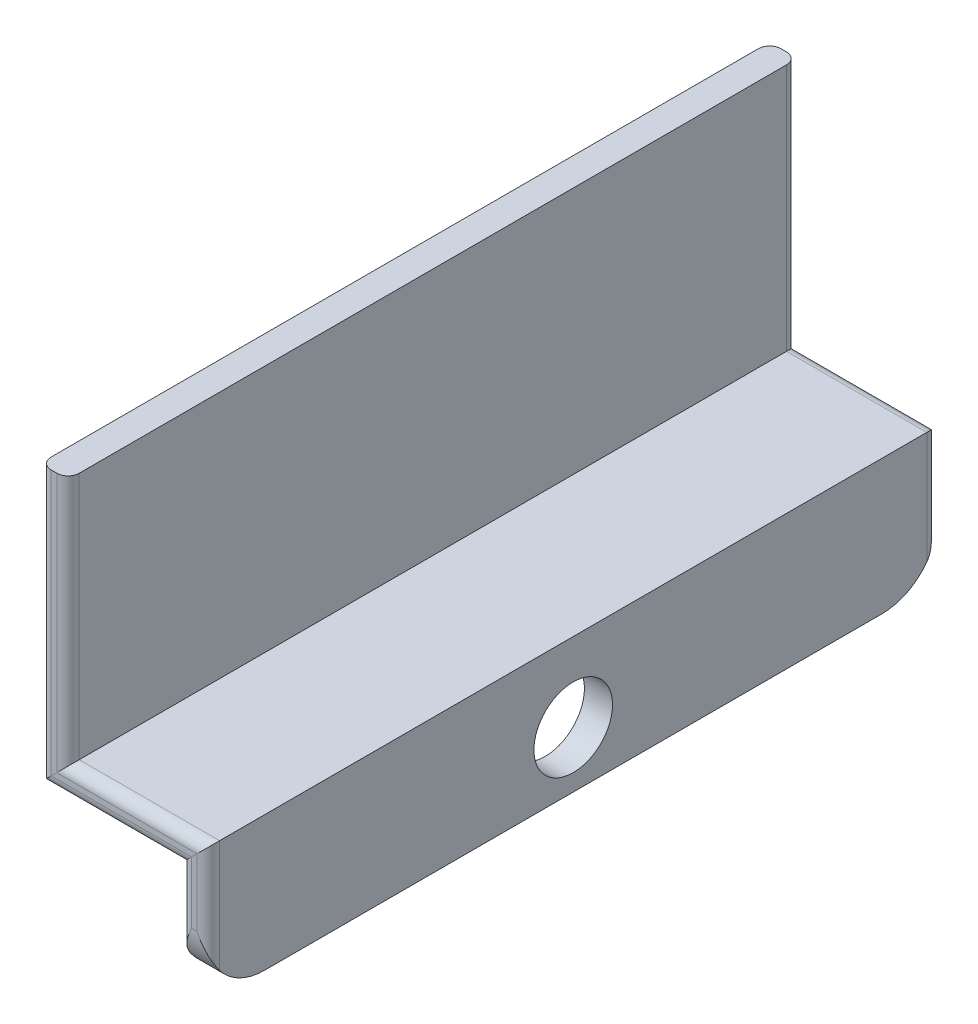
ISO-10303-21;
HEADER;
FILE_DESCRIPTION(('STEP AP214'),'2;1');
FILE_NAME('part.step','',(''),(''),'','','');
FILE_SCHEMA(('AUTOMOTIVE_DESIGN { 1 0 10303 214 1 1 1 1 }'));
ENDSEC;
DATA;
#1=APPLICATION_CONTEXT('core data for automotive mechanical design processes');
#2=APPLICATION_PROTOCOL_DEFINITION('international standard','automotive_design',2000,#1);
#3=PRODUCT_CONTEXT('',#1,'mechanical');
#4=PRODUCT('Part','Part','',(#3));
#5=PRODUCT_RELATED_PRODUCT_CATEGORY('part','',(#4));
#6=PRODUCT_DEFINITION_FORMATION('','',#4);
#7=PRODUCT_DEFINITION_CONTEXT('part definition',#1,'design');
#8=PRODUCT_DEFINITION('design','',#6,#7);
#9=PRODUCT_DEFINITION_SHAPE('','',#8);
#10=(LENGTH_UNIT() NAMED_UNIT(*) SI_UNIT(.MILLI.,.METRE.));
#11=(NAMED_UNIT(*) PLANE_ANGLE_UNIT() SI_UNIT($,.RADIAN.));
#12=(NAMED_UNIT(*) SI_UNIT($,.STERADIAN.) SOLID_ANGLE_UNIT());
#13=UNCERTAINTY_MEASURE_WITH_UNIT(LENGTH_MEASURE(1.E-05),#10,'distance_accuracy_value','');
#14=(GEOMETRIC_REPRESENTATION_CONTEXT(3) GLOBAL_UNCERTAINTY_ASSIGNED_CONTEXT((#13)) GLOBAL_UNIT_ASSIGNED_CONTEXT((#10,
#11,#12)) REPRESENTATION_CONTEXT('',''));
#15=CARTESIAN_POINT('',(0.,0.,0.));
#16=DIRECTION('',(0.,0.,1.));
#17=DIRECTION('',(1.,0.,0.));
#18=AXIS2_PLACEMENT_3D('',#15,#16,#17);
#19=CARTESIAN_POINT('',(-0.499999999999993,10.,55.));
#20=DIRECTION('',(1.,0.,0.));
#21=DIRECTION('',(0.,0.,-1.));
#22=AXIS2_PLACEMENT_3D('',#19,#20,#21);
#23=CYLINDRICAL_SURFACE('',#22,10.);
#24=DIRECTION('',(1.,0.,0.));
#25=VECTOR('',#24,1.);
#26=CARTESIAN_POINT('',(-0.499999999999993,10.,65.));
#27=LINE('',#26,#25);
#28=CARTESIAN_POINT('',(-0.499999999999993,10.,65.));
#29=VERTEX_POINT('',#28);
#30=CARTESIAN_POINT('',(0.500000000000008,10.,65.));
#31=VERTEX_POINT('',#30);
#32=EDGE_CURVE('E347',#29,#31,#27,.T.);
#33=ORIENTED_EDGE('',*,*,#32,.F.);
#34=CARTESIAN_POINT('',(-2.49999999999999,4.00000000000001,63.));
#35=CARTESIAN_POINT('',(-2.49999547043244,4.06304637753697,63.0472862882958));
#36=CARTESIAN_POINT('',(-2.49832361454912,4.12663757747305,63.093813478753));
#37=CARTESIAN_POINT('',(-2.49192859183356,4.25478005250355,63.1852695333377));
#38=CARTESIAN_POINT('',(-2.48720638983413,4.31933101771625,63.2301988981225));
#39=CARTESIAN_POINT('',(-2.46891171954804,4.51402968416605,63.3623378279782));
#40=CARTESIAN_POINT('',(-2.45120888558428,4.64547618874946,63.4470878572115));
#41=CARTESIAN_POINT('',(-2.40682523983019,4.91010869140637,63.6091190391928));
#42=CARTESIAN_POINT('',(-2.38020606759935,5.0432768704808,63.6864469043147));
#43=CARTESIAN_POINT('',(-2.31945242255605,5.31177170751565,63.8342526275325));
#44=CARTESIAN_POINT('',(-2.28531301078787,5.44709972953324,63.904725939813));
#45=CARTESIAN_POINT('',(-2.18706305090996,5.8061393307985,64.0814771097219));
#46=CARTESIAN_POINT('',(-2.11770825700137,6.03127255594251,64.1819879312216));
#47=CARTESIAN_POINT('',(-1.96662002756913,6.48468424964298,64.364955146067));
#48=CARTESIAN_POINT('',(-1.88488135721311,6.71296401101095,64.4474038680966));
#49=CARTESIAN_POINT('',(-1.7119794583594,7.17260428488559,64.5950152471494));
#50=CARTESIAN_POINT('',(-1.6207807482313,7.40397333561157,64.6601092975224));
#51=CARTESIAN_POINT('',(-1.43190515621657,7.86814150222461,64.7730351186085));
#52=CARTESIAN_POINT('',(-1.3342303647904,8.10094013484107,64.8208724279425));
#53=CARTESIAN_POINT('',(-1.11715554079996,8.60820812759128,64.9065704488633));
#54=CARTESIAN_POINT('',(-0.996936925704238,8.88286585590204,64.9412373642432));
#55=CARTESIAN_POINT('',(-0.753857161670149,9.43229712763855,64.9876693958687));
#56=CARTESIAN_POINT('',(-0.631002027540831,9.70706924260041,64.9994819850184));
#57=CARTESIAN_POINT('',(-0.505443288842875,9.98782843433309,64.99999444154));
#58=CARTESIAN_POINT('',(-0.502721632048848,9.99391424381279,64.9999999968566));
#59=CARTESIAN_POINT('',(-0.499999999999993,10.,65.));
#60=B_SPLINE_CURVE_WITH_KNOTS('',3,(#34,#35,#36,#37,#38,#39,#40,#41,#42,#43,#44,#45,#46,#47,#48,
#49,#50,#51,#52,#53,#54,#55,#56,#57,#58,#59),.UNSPECIFIED.,.F.,.F.,(4,2,2,2,2,2,2,2,2,2,2,2,4),
(0.,0.236371159892512,0.472667591527449,0.944315101861264,1.41276713949794,1.88152775757087,
2.64870335126649,3.41620414998905,4.18669550285099,4.95693934291841,5.86148159841717,
6.76414291697835,6.78414292392341),.UNSPECIFIED.);
#61=CARTESIAN_POINT('',(-2.49999999999999,4.00000000000001,63.));
#62=VERTEX_POINT('',#61);
#63=EDGE_CURVE('E11',#62,#29,#60,.T.);
#64=ORIENTED_EDGE('',*,*,#63,.F.);
#65=CARTESIAN_POINT('',(-2.49999999999999,10.,55.));
#66=DIRECTION('',(-1.,0.,0.));
#67=DIRECTION('',(0.,0.,1.));
#68=AXIS2_PLACEMENT_3D('',#65,#66,#67);
#69=CIRCLE('',#68,10.);
#70=CARTESIAN_POINT('',(-2.49999999999999,0.,55.));
#71=VERTEX_POINT('',#70);
#72=EDGE_CURVE('E49',#71,#62,#69,.T.);
#73=ORIENTED_EDGE('',*,*,#72,.F.);
#74=DIRECTION('',(1.,0.,0.));
#75=VECTOR('',#74,1.);
#76=CARTESIAN_POINT('',(0.499999999999992,0.,55.));
#77=LINE('',#76,#75);
#78=CARTESIAN_POINT('',(2.50000000000001,0.,55.));
#79=VERTEX_POINT('',#78);
#80=EDGE_CURVE('E474',#79,#71,#77,.F.);
#81=ORIENTED_EDGE('',*,*,#80,.F.);
#82=CARTESIAN_POINT('',(2.50000000000001,10.,55.));
#83=DIRECTION('',(1.,0.,0.));
#84=DIRECTION('',(0.,0.,-1.));
#85=AXIS2_PLACEMENT_3D('',#82,#83,#84);
#86=CIRCLE('',#85,10.);
#87=CARTESIAN_POINT('',(2.50000000000001,4.00000000000001,63.));
#88=VERTEX_POINT('',#87);
#89=EDGE_CURVE('E475',#88,#79,#86,.T.);
#90=ORIENTED_EDGE('',*,*,#89,.F.);
#91=CARTESIAN_POINT('',(0.500000000000008,10.,65.));
#92=CARTESIAN_POINT('',(0.502721628399615,9.99391425084165,64.9999999965994));
#93=CARTESIAN_POINT('',(0.505443285212219,9.98782844131885,64.9999944412989));
#94=CARTESIAN_POINT('',(0.642839640476698,9.68059946278816,64.999433683535));
#95=CARTESIAN_POINT('',(0.777544798684673,9.37932057803113,64.9852882408832));
#96=CARTESIAN_POINT('',(1.04327113471868,8.77740035527913,64.9295886716854));
#97=CARTESIAN_POINT('',(1.17428874575255,8.47675987815172,64.8880088990259));
#98=CARTESIAN_POINT('',(1.42867458267128,7.87673702040747,64.7767569341569));
#99=CARTESIAN_POINT('',(1.55202957555319,7.57735760535633,64.7070376217039));
#100=CARTESIAN_POINT('',(1.78572898308166,6.98194801878022,64.5387111228695));
#101=CARTESIAN_POINT('',(1.89608655158132,6.68591474005417,64.4401335005981));
#102=CARTESIAN_POINT('',(2.09232369803455,6.11354886559747,64.2187128467075));
#103=CARTESIAN_POINT('',(2.17916593611921,5.83698257130332,64.0973671885433));
#104=CARTESIAN_POINT('',(2.29024836784087,5.42797135928678,63.8949186385683));
#105=CARTESIAN_POINT('',(2.32402390435839,5.29290748653502,63.8242143371832));
#106=CARTESIAN_POINT('',(2.38402833961434,5.02484413603067,63.6759018440058));
#107=CARTESIAN_POINT('',(2.41025661874056,4.89184482862158,63.5982930860581));
#108=CARTESIAN_POINT('',(2.45026840218955,4.64893178433829,63.4488538806291));
#109=CARTESIAN_POINT('',(2.46535101868504,4.5386363826575,63.3779936451009));
#110=CARTESIAN_POINT('',(2.48791968612418,4.32044190393643,63.2316379999814));
#111=CARTESIAN_POINT('',(2.49541038857459,4.21254139925162,63.1561454586777));
#112=CARTESIAN_POINT('',(2.50153963009505,3.99856716219276,63.000031068604));
#113=CARTESIAN_POINT('',(2.50009094149456,3.89252158861953,62.9193663015082));
#114=CARTESIAN_POINT('',(2.48994271305687,3.73615542879902,62.7954277633358));
#115=CARTESIAN_POINT('',(2.48522141633947,3.68442974533144,62.75357823854));
#116=CARTESIAN_POINT('',(2.47288472291966,3.58201051799564,62.6690174067095));
#117=CARTESIAN_POINT('',(2.46526832160248,3.53131733885191,62.6263058054075));
#118=CARTESIAN_POINT('',(2.4560925472339,3.48120344431526,62.5832243449335));
#119=B_SPLINE_CURVE_WITH_KNOTS('',3,(#91,#92,#93,#94,#95,#96,#97,#98,#99,#100,#101,#102,#103,
#104,#105,#106,#107,#108,#109,#110,#111,#112,#113,#114,#115,#116,#117,#118),.UNSPECIFIED.,.F.,
.F.,(4,2,2,2,2,2,2,2,2,2,2,2,2,4),(0.,0.0200000069444667,1.00964805019351,2.00022254779432,
2.99246271075223,3.98368990203602,4.9242652636444,5.3924313134945,5.86063578772613,
6.2562352909762,6.65159226669092,7.05081306741995,7.25085282834555,7.45096206746141),.UNSPECIFIED.);
#120=EDGE_CURVE('E432',#31,#88,#119,.T.);
#121=ORIENTED_EDGE('',*,*,#120,.F.);
#122=EDGE_LOOP('',(#33,#64,#73,#81,#90,#121));
#123=FACE_BOUND('',#122,.T.);
#124=ADVANCED_FACE('F36',(#123),#23,.T.);
#125=CARTESIAN_POINT('',(-0.500000000000008,10.,-55.));
#126=DIRECTION('',(-1.,0.,0.));
#127=DIRECTION('',(0.,0.,1.));
#128=AXIS2_PLACEMENT_3D('',#125,#126,#127);
#129=CYLINDRICAL_SURFACE('',#128,10.);
#130=DIRECTION('',(-1.,0.,0.));
#131=VECTOR('',#130,1.);
#132=CARTESIAN_POINT('',(-0.500000000000008,10.,-65.));
#133=LINE('',#132,#131);
#134=CARTESIAN_POINT('',(0.499999999999992,10.,-65.));
#135=VERTEX_POINT('',#134);
#136=CARTESIAN_POINT('',(-0.500000000000008,10.,-65.));
#137=VERTEX_POINT('',#136);
#138=EDGE_CURVE('E168',#135,#137,#133,.T.);
#139=ORIENTED_EDGE('',*,*,#138,.F.);
#140=CARTESIAN_POINT('',(2.49999999999999,3.99999999999999,-63.));
#141=CARTESIAN_POINT('',(2.49999547043244,4.06304637753687,-63.0472862882957));
#142=CARTESIAN_POINT('',(2.49832361454912,4.12663757747287,-63.0938134787529));
#143=CARTESIAN_POINT('',(2.49192859183358,4.2547800525032,-63.1852695333375));
#144=CARTESIAN_POINT('',(2.48720638983416,4.31933101771581,-63.2301988981222));
#145=CARTESIAN_POINT('',(2.46891171954812,4.51402968416534,-63.3623378279777));
#146=CARTESIAN_POINT('',(2.4512088855844,4.64547618874857,-63.447087857211));
#147=CARTESIAN_POINT('',(2.40682523983037,4.91010869140545,-63.6091190391923));
#148=CARTESIAN_POINT('',(2.3802060675995,5.04327687048006,-63.6864469043143));
#149=CARTESIAN_POINT('',(2.31945242255614,5.31177170751526,-63.8342526275324));
#150=CARTESIAN_POINT('',(2.28531301078792,5.44709972953303,-63.904725939813));
#151=CARTESIAN_POINT('',(2.18706305090993,5.8061393307986,-64.0814771097219));
#152=CARTESIAN_POINT('',(2.11770825700131,6.03127255594274,-64.1819879312217));
#153=CARTESIAN_POINT('',(1.96662002756895,6.48468424964342,-64.3649551460672));
#154=CARTESIAN_POINT('',(1.88488135721282,6.71296401101147,-64.4474038680968));
#155=CARTESIAN_POINT('',(1.71197945835927,7.17260428488616,-64.5950152471496));
#156=CARTESIAN_POINT('',(1.62078074823145,7.4039733356121,-64.6601092975225));
#157=CARTESIAN_POINT('',(1.43190515621617,7.86814150222462,-64.7730351186086));
#158=CARTESIAN_POINT('',(1.33423036478917,8.10094013484059,-64.8208724279425));
#159=CARTESIAN_POINT('',(1.11715554080136,8.60820812759183,-64.9065704488633));
#160=CARTESIAN_POINT('',(0.996936925709866,8.88286585590448,-64.9412373642432));
#161=CARTESIAN_POINT('',(0.753857161664523,9.43229712763598,-64.9876693958688));
#162=CARTESIAN_POINT('',(0.631002027519763,9.70706924259096,-64.9994819850186));
#163=CARTESIAN_POINT('',(0.505443288841949,9.98782843433267,-64.99999444154));
#164=CARTESIAN_POINT('',(0.502721632048376,9.99391424381258,-64.9999999968566));
#165=CARTESIAN_POINT('',(0.499999999999992,10.,-65.));
#166=B_SPLINE_CURVE_WITH_KNOTS('',3,(#140,#141,#142,#143,#144,#145,#146,#147,#148,#149,#150,
#151,#152,#153,#154,#155,#156,#157,#158,#159,#160,#161,#162,#163,#164,#165),.UNSPECIFIED.,.F.,
.F.,(4,2,2,2,2,2,2,2,2,2,2,2,4),(0.,0.236371159892205,0.47266759152683,0.944315101860007,
1.4127671394973,1.88152775757086,2.6487033512669,3.4162041499898,4.1866955028513,
4.95693934291837,5.8614815984171,6.76414291697836,6.78414292392343),.UNSPECIFIED.);
#167=CARTESIAN_POINT('',(2.49999999999999,3.99999999999999,-63.));
#168=VERTEX_POINT('',#167);
#169=EDGE_CURVE('E339',#168,#135,#166,.T.);
#170=ORIENTED_EDGE('',*,*,#169,.F.);
#171=CARTESIAN_POINT('',(2.49999999999999,10.,-55.));
#172=DIRECTION('',(1.,0.,0.));
#173=DIRECTION('',(0.,0.,-1.));
#174=AXIS2_PLACEMENT_3D('',#171,#172,#173);
#175=CIRCLE('',#174,10.);
#176=CARTESIAN_POINT('',(2.49999999999999,0.,-55.));
#177=VERTEX_POINT('',#176);
#178=EDGE_CURVE('E348',#177,#168,#175,.T.);
#179=ORIENTED_EDGE('',*,*,#178,.F.);
#180=DIRECTION('',(-1.,0.,0.));
#181=VECTOR('',#180,1.);
#182=CARTESIAN_POINT('',(0.499999999999992,0.,-55.));
#183=LINE('',#182,#181);
#184=CARTESIAN_POINT('',(-2.50000000000001,0.,-55.));
#185=VERTEX_POINT('',#184);
#186=EDGE_CURVE('E674',#185,#177,#183,.F.);
#187=ORIENTED_EDGE('',*,*,#186,.F.);
#188=CARTESIAN_POINT('',(-2.50000000000001,10.,-55.));
#189=DIRECTION('',(-1.,0.,0.));
#190=DIRECTION('',(0.,0.,1.));
#191=AXIS2_PLACEMENT_3D('',#188,#189,#190);
#192=CIRCLE('',#191,10.);
#193=CARTESIAN_POINT('',(-2.50000000000001,3.99999999999999,-63.));
#194=VERTEX_POINT('',#193);
#195=EDGE_CURVE('E325',#194,#185,#192,.T.);
#196=ORIENTED_EDGE('',*,*,#195,.F.);
#197=CARTESIAN_POINT('',(-0.500000000000008,10.,-65.));
#198=CARTESIAN_POINT('',(-0.502721628399066,9.99391425084141,-64.9999999965994));
#199=CARTESIAN_POINT('',(-0.505443285211139,9.98782844131837,-64.9999944412989));
#200=CARTESIAN_POINT('',(-0.642839640444456,9.68059946278795,-64.9994336835353));
#201=CARTESIAN_POINT('',(-0.777544798666836,9.37932057805158,-64.9852882408844));
#202=CARTESIAN_POINT('',(-1.04327113470509,8.77740035532974,-64.9295886716909));
#203=CARTESIAN_POINT('',(-1.17428874572878,8.47675987821183,-64.8880088990346));
#204=CARTESIAN_POINT('',(-1.42867458263471,7.87673702048958,-64.7767569341746));
#205=CARTESIAN_POINT('',(-1.55202957551402,7.57735760545096,-64.7070376217272));
#206=CARTESIAN_POINT('',(-1.78572898303726,6.98194801889843,-64.5387111229064));
#207=CARTESIAN_POINT('',(-1.89608655153428,6.68591474018346,-64.440133500643));
#208=CARTESIAN_POINT('',(-2.09232369799681,6.11354886571502,-64.2187128467578));
#209=CARTESIAN_POINT('',(-2.1791659360912,5.83698257139857,-64.0973671885877));
#210=CARTESIAN_POINT('',(-2.29024836782501,5.42797135934904,-63.8949186386005));
#211=CARTESIAN_POINT('',(-2.3240239043462,5.2929074865863,-63.8242143372107));
#212=CARTESIAN_POINT('',(-2.38402833960843,5.02484413606024,-63.675901844023));
#213=CARTESIAN_POINT('',(-2.41025661873727,4.89184482864045,-63.5982930860695));
#214=CARTESIAN_POINT('',(-2.45026840218792,4.64893178434909,-63.448853880636));
#215=CARTESIAN_POINT('',(-2.46535101868332,4.53863638267071,-63.3779936451095));
#216=CARTESIAN_POINT('',(-2.48791968612268,4.32044190395432,-63.2316379999937));
#217=CARTESIAN_POINT('',(-2.49541038857339,4.21254139927179,-63.156145458692));
#218=CARTESIAN_POINT('',(-2.50153963009495,3.99856716221775,-63.0000310686227));
#219=CARTESIAN_POINT('',(-2.5000909414953,3.89252158864704,-62.9193663015294));
#220=CARTESIAN_POINT('',(-2.48994271305941,3.73615542883011,-62.7954277633608));
#221=CARTESIAN_POINT('',(-2.4852214163427,3.68442974536369,-62.7535782385662));
#222=CARTESIAN_POINT('',(-2.47288472292447,3.58201051803014,-62.6690174067384));
#223=CARTESIAN_POINT('',(-2.46526832160818,3.53131733888749,-62.6263058054377));
#224=CARTESIAN_POINT('',(-2.45609254724062,3.48120344435189,-62.583224344965));
#225=B_SPLINE_CURVE_WITH_KNOTS('',3,(#197,#198,#199,#200,#201,#202,#203,#204,#205,#206,#207,
#208,#209,#210,#211,#212,#213,#214,#215,#216,#217,#218,#219,#220,#221,#222,#223,#224),
.UNSPECIFIED.,.F.,.F.,(4,2,2,2,2,2,2,2,2,2,2,2,2,4),(0.,0.0200000069444654,1.00964805015461,
2.00022254771616,2.99246271063398,3.98368990187851,4.92426526356025,5.39243131344749,
5.86063578771627,6.25623529095746,6.65159226666328,7.05081306738183,7.25085282830217,
7.45096206741274),.UNSPECIFIED.);
#226=EDGE_CURVE('E201',#137,#194,#225,.T.);
#227=ORIENTED_EDGE('',*,*,#226,.F.);
#228=EDGE_LOOP('',(#139,#170,#179,#187,#196,#227));
#229=FACE_BOUND('',#228,.T.);
#230=ADVANCED_FACE('F330',(#229),#129,.T.);
#231=CARTESIAN_POINT('',(-24.5,68.2,-63.0000000000001));
#232=DIRECTION('',(0.,-1.,0.));
#233=DIRECTION('',(0.,0.,-1.));
#234=AXIS2_PLACEMENT_3D('',#231,#232,#233);
#235=PLANE('',#234);
#236=CARTESIAN_POINT('',(-24.5,68.2,-63.0000000000001));
#237=DIRECTION('',(0.,1.,0.));
#238=DIRECTION('',(0.,0.,-1.));
#239=AXIS2_PLACEMENT_3D('',#236,#237,#238);
#240=CIRCLE('',#239,2.);
#241=CARTESIAN_POINT('',(-22.5,68.2,-63.0000000000001));
#242=VERTEX_POINT('',#241);
#243=CARTESIAN_POINT('',(-24.5,68.2,-65.0000000000001));
#244=VERTEX_POINT('',#243);
#245=EDGE_CURVE('E277',#242,#244,#240,.T.);
#246=ORIENTED_EDGE('',*,*,#245,.T.);
#247=DIRECTION('',(-1.,0.,0.));
#248=VECTOR('',#247,1.);
#249=CARTESIAN_POINT('',(-25.5,68.2,-65.0000000000001));
#250=LINE('',#249,#248);
#251=CARTESIAN_POINT('',(-25.5,68.2,-65.0000000000001));
#252=VERTEX_POINT('',#251);
#253=EDGE_CURVE('E292',#244,#252,#250,.T.);
#254=ORIENTED_EDGE('',*,*,#253,.T.);
#255=CARTESIAN_POINT('',(-25.5,68.2,-63.0000000000001));
#256=DIRECTION('',(0.,1.,0.));
#257=DIRECTION('',(0.,0.,-1.));
#258=AXIS2_PLACEMENT_3D('',#255,#256,#257);
#259=CIRCLE('',#258,2.);
#260=CARTESIAN_POINT('',(-27.5,68.2,-63.0000000000001));
#261=VERTEX_POINT('',#260);
#262=EDGE_CURVE('E290',#252,#261,#259,.T.);
#263=ORIENTED_EDGE('',*,*,#262,.T.);
#264=DIRECTION('',(0.,0.,1.));
#265=VECTOR('',#264,1.);
#266=CARTESIAN_POINT('',(-27.5,68.2,-63.0000000000001));
#267=LINE('',#266,#265);
#268=CARTESIAN_POINT('',(-27.5,68.2,62.9999999999999));
#269=VERTEX_POINT('',#268);
#270=EDGE_CURVE('E288',#261,#269,#267,.T.);
#271=ORIENTED_EDGE('',*,*,#270,.T.);
#272=CARTESIAN_POINT('',(-25.5,68.2,62.9999999999999));
#273=DIRECTION('',(0.,1.,0.));
#274=DIRECTION('',(0.,0.,-1.));
#275=AXIS2_PLACEMENT_3D('',#272,#273,#274);
#276=CIRCLE('',#275,2.);
#277=CARTESIAN_POINT('',(-25.5,68.2,64.9999999999999));
#278=VERTEX_POINT('',#277);
#279=EDGE_CURVE('E286',#269,#278,#276,.T.);
#280=ORIENTED_EDGE('',*,*,#279,.T.);
#281=DIRECTION('',(1.,0.,0.));
#282=VECTOR('',#281,1.);
#283=CARTESIAN_POINT('',(-25.5,68.2,64.9999999999999));
#284=LINE('',#283,#282);
#285=CARTESIAN_POINT('',(-24.5,68.2,64.9999999999999));
#286=VERTEX_POINT('',#285);
#287=EDGE_CURVE('E284',#278,#286,#284,.T.);
#288=ORIENTED_EDGE('',*,*,#287,.T.);
#289=CARTESIAN_POINT('',(-24.5,68.2,62.9999999999999));
#290=DIRECTION('',(0.,1.,0.));
#291=DIRECTION('',(0.,0.,-1.));
#292=AXIS2_PLACEMENT_3D('',#289,#290,#291);
#293=CIRCLE('',#292,2.);
#294=CARTESIAN_POINT('',(-22.5,68.2,62.9999999999999));
#295=VERTEX_POINT('',#294);
#296=EDGE_CURVE('E282',#286,#295,#293,.T.);
#297=ORIENTED_EDGE('',*,*,#296,.T.);
#298=DIRECTION('',(0.,0.,-1.));
#299=VECTOR('',#298,1.);
#300=CARTESIAN_POINT('',(-22.5,68.2,-63.0000000000001));
#301=LINE('',#300,#299);
#302=EDGE_CURVE('E279',#295,#242,#301,.T.);
#303=ORIENTED_EDGE('',*,*,#302,.T.);
#304=EDGE_LOOP('',(#246,#254,#263,#271,#280,#288,#297,#303));
#305=FACE_BOUND('',#304,.T.);
#306=ADVANCED_FACE('F334',(#305),#235,.F.);
#307=CARTESIAN_POINT('',(0.499999999999992,0.,-63.));
#308=DIRECTION('',(0.,-1.,0.));
#309=DIRECTION('',(0.,0.,-1.));
#310=AXIS2_PLACEMENT_3D('',#307,#308,#309);
#311=PLANE('',#310);
#312=DIRECTION('',(0.,0.,-1.));
#313=VECTOR('',#312,1.);
#314=CARTESIAN_POINT('',(2.49999999999999,0.,-63.));
#315=LINE('',#314,#313);
#316=EDGE_CURVE('E223',#79,#177,#315,.T.);
#317=ORIENTED_EDGE('',*,*,#316,.F.);
#318=ORIENTED_EDGE('',*,*,#80,.T.);
#319=DIRECTION('',(0.,0.,1.));
#320=VECTOR('',#319,1.);
#321=CARTESIAN_POINT('',(-2.50000000000001,0.,-63.));
#322=LINE('',#321,#320);
#323=EDGE_CURVE('E226',#185,#71,#322,.T.);
#324=ORIENTED_EDGE('',*,*,#323,.F.);
#325=ORIENTED_EDGE('',*,*,#186,.T.);
#326=EDGE_LOOP('',(#317,#318,#324,#325));
#327=FACE_BOUND('',#326,.T.);
#328=ADVANCED_FACE('F391',(#327),#311,.T.);
#329=CARTESIAN_POINT('',(-25.5,18.6499999999999,-65.0000000000001));
#330=DIRECTION('',(0.,0.,-1.));
#331=DIRECTION('',(0.,1.,0.));
#332=AXIS2_PLACEMENT_3D('',#329,#330,#331);
#333=PLANE('',#332);
#334=DIRECTION('',(0.707106781186548,0.707106781186548,0.));
#335=VECTOR('',#334,1.);
#336=CARTESIAN_POINT('',(-11.3249999999999,35.175,-65.0000000000001));
#337=LINE('',#336,#335);
#338=CARTESIAN_POINT('',(-25.5,20.9999999999999,-65.0000000000001));
#339=VERTEX_POINT('',#338);
#340=CARTESIAN_POINT('',(-24.5,21.9999999999999,-65.0000000000001));
#341=VERTEX_POINT('',#340);
#342=EDGE_CURVE('E257',#339,#341,#337,.T.);
#343=ORIENTED_EDGE('',*,*,#342,.F.);
#344=DIRECTION('',(0.,1.,0.));
#345=VECTOR('',#344,1.);
#346=CARTESIAN_POINT('',(-25.5,18.6499999999999,-65.0000000000001));
#347=LINE('',#346,#345);
#348=EDGE_CURVE('E312',#339,#252,#347,.T.);
#349=ORIENTED_EDGE('',*,*,#348,.T.);
#350=ORIENTED_EDGE('',*,*,#253,.F.);
#351=DIRECTION('',(0.,1.,0.));
#352=VECTOR('',#351,1.);
#353=CARTESIAN_POINT('',(-24.5,18.6499999999999,-65.0000000000001));
#354=LINE('',#353,#352);
#355=EDGE_CURVE('E262',#341,#244,#354,.T.);
#356=ORIENTED_EDGE('',*,*,#355,.F.);
#357=EDGE_LOOP('',(#343,#349,#350,#356));
#358=FACE_BOUND('',#357,.T.);
#359=ADVANCED_FACE('F387',(#358),#333,.T.);
#360=CARTESIAN_POINT('',(-25.5,18.6499999999999,-63.0000000000001));
#361=DIRECTION('',(0.,1.,0.));
#362=DIRECTION('',(0.,0.,1.));
#363=AXIS2_PLACEMENT_3D('',#360,#361,#362);
#364=CYLINDRICAL_SURFACE('',#363,2.);
#365=CARTESIAN_POINT('',(-25.5,20.9999999999998,-63.0000000000001));
#366=DIRECTION('',(-0.707106781186547,0.707106781186547,0.));
#367=DIRECTION('',(-0.707106781186548,-0.707106781186548,0.));
#368=AXIS2_PLACEMENT_3D('',#365,#366,#367);
#369=ELLIPSE('',#368,2.82842712474619,2.);
#370=CARTESIAN_POINT('',(-27.5,18.9999999999999,-63.0000000000001));
#371=VERTEX_POINT('',#370);
#372=EDGE_CURVE('E194',#371,#339,#369,.F.);
#373=ORIENTED_EDGE('',*,*,#372,.F.);
#374=DIRECTION('',(0.,1.,0.));
#375=VECTOR('',#374,1.);
#376=CARTESIAN_POINT('',(-27.5,18.6499999999999,-63.0000000000001));
#377=LINE('',#376,#375);
#378=EDGE_CURVE('E309',#371,#261,#377,.T.);
#379=ORIENTED_EDGE('',*,*,#378,.T.);
#380=ORIENTED_EDGE('',*,*,#262,.F.);
#381=ORIENTED_EDGE('',*,*,#348,.F.);
#382=EDGE_LOOP('',(#373,#379,#380,#381));
#383=FACE_BOUND('',#382,.T.);
#384=ADVANCED_FACE('F390',(#383),#364,.T.);
#385=CARTESIAN_POINT('',(-27.5,18.6499999999999,-63.0000000000001));
#386=DIRECTION('',(-1.,0.,0.));
#387=DIRECTION('',(0.,0.,1.));
#388=AXIS2_PLACEMENT_3D('',#385,#386,#387);
#389=PLANE('',#388);
#390=DIRECTION('',(0.,0.,-1.));
#391=VECTOR('',#390,1.);
#392=CARTESIAN_POINT('',(-27.5,18.9999999999998,-63.));
#393=LINE('',#392,#391);
#394=CARTESIAN_POINT('',(-27.5,19.0000000000001,62.9999999999999));
#395=VERTEX_POINT('',#394);
#396=EDGE_CURVE('E239',#395,#371,#393,.T.);
#397=ORIENTED_EDGE('',*,*,#396,.F.);
#398=DIRECTION('',(0.,1.,0.));
#399=VECTOR('',#398,1.);
#400=CARTESIAN_POINT('',(-27.5,18.6499999999999,62.9999999999999));
#401=LINE('',#400,#399);
#402=EDGE_CURVE('E306',#395,#269,#401,.T.);
#403=ORIENTED_EDGE('',*,*,#402,.T.);
#404=ORIENTED_EDGE('',*,*,#270,.F.);
#405=ORIENTED_EDGE('',*,*,#378,.F.);
#406=EDGE_LOOP('',(#397,#403,#404,#405));
#407=FACE_BOUND('',#406,.T.);
#408=ADVANCED_FACE('F395',(#407),#389,.T.);
#409=CARTESIAN_POINT('',(-25.5,18.6499999999999,62.9999999999999));
#410=DIRECTION('',(0.,1.,0.));
#411=DIRECTION('',(0.,0.,1.));
#412=AXIS2_PLACEMENT_3D('',#409,#410,#411);
#413=CYLINDRICAL_SURFACE('',#412,2.);
#414=CARTESIAN_POINT('',(-25.5,21.0000000000001,62.9999999999999));
#415=DIRECTION('',(-0.707106781186547,0.707106781186547,0.));
#416=DIRECTION('',(-0.707106781186548,-0.707106781186548,0.));
#417=AXIS2_PLACEMENT_3D('',#414,#415,#416);
#418=ELLIPSE('',#417,2.82842712474619,2.);
#419=CARTESIAN_POINT('',(-25.5,21.0000000000001,64.9999999999999));
#420=VERTEX_POINT('',#419);
#421=EDGE_CURVE('E242',#420,#395,#418,.F.);
#422=ORIENTED_EDGE('',*,*,#421,.F.);
#423=DIRECTION('',(0.,1.,0.));
#424=VECTOR('',#423,1.);
#425=CARTESIAN_POINT('',(-25.5,18.6499999999999,64.9999999999999));
#426=LINE('',#425,#424);
#427=EDGE_CURVE('E303',#420,#278,#426,.T.);
#428=ORIENTED_EDGE('',*,*,#427,.T.);
#429=ORIENTED_EDGE('',*,*,#279,.F.);
#430=ORIENTED_EDGE('',*,*,#402,.F.);
#431=EDGE_LOOP('',(#422,#428,#429,#430));
#432=FACE_BOUND('',#431,.T.);
#433=ADVANCED_FACE('F399',(#432),#413,.T.);
#434=CARTESIAN_POINT('',(-25.5,18.6499999999999,64.9999999999999));
#435=DIRECTION('',(0.,0.,1.));
#436=DIRECTION('',(0.,-1.,0.));
#437=AXIS2_PLACEMENT_3D('',#434,#435,#436);
#438=PLANE('',#437);
#439=DIRECTION('',(-0.707106781186548,-0.707106781186548,0.));
#440=VECTOR('',#439,1.);
#441=CARTESIAN_POINT('',(-11.325,35.1750000000001,64.9999999999999));
#442=LINE('',#441,#440);
#443=CARTESIAN_POINT('',(-24.5,22.0000000000001,64.9999999999999));
#444=VERTEX_POINT('',#443);
#445=EDGE_CURVE('E245',#444,#420,#442,.T.);
#446=ORIENTED_EDGE('',*,*,#445,.F.);
#447=DIRECTION('',(0.,1.,0.));
#448=VECTOR('',#447,1.);
#449=CARTESIAN_POINT('',(-24.5,18.6499999999999,64.9999999999999));
#450=LINE('',#449,#448);
#451=EDGE_CURVE('E300',#444,#286,#450,.T.);
#452=ORIENTED_EDGE('',*,*,#451,.T.);
#453=ORIENTED_EDGE('',*,*,#287,.F.);
#454=ORIENTED_EDGE('',*,*,#427,.F.);
#455=EDGE_LOOP('',(#446,#452,#453,#454));
#456=FACE_BOUND('',#455,.T.);
#457=ADVANCED_FACE('F403',(#456),#438,.T.);
#458=CARTESIAN_POINT('',(-24.5,18.6499999999999,62.9999999999999));
#459=DIRECTION('',(0.,1.,0.));
#460=DIRECTION('',(0.,0.,1.));
#461=AXIS2_PLACEMENT_3D('',#458,#459,#460);
#462=CYLINDRICAL_SURFACE('',#461,2.);
#463=CARTESIAN_POINT('',(-24.5,22.0000000000001,62.9999999999999));
#464=DIRECTION('',(-0.707106781186547,0.707106781186547,0.));
#465=DIRECTION('',(-0.707106781186548,-0.707106781186548,0.));
#466=AXIS2_PLACEMENT_3D('',#463,#464,#465);
#467=ELLIPSE('',#466,2.82842712474619,2.);
#468=CARTESIAN_POINT('',(-22.5,24.0000000000001,62.9999999999999));
#469=VERTEX_POINT('',#468);
#470=EDGE_CURVE('E248',#469,#444,#467,.F.);
#471=ORIENTED_EDGE('',*,*,#470,.F.);
#472=DIRECTION('',(0.,1.,0.));
#473=VECTOR('',#472,1.);
#474=CARTESIAN_POINT('',(-22.5,18.6499999999999,62.9999999999999));
#475=LINE('',#474,#473);
#476=EDGE_CURVE('E297',#469,#295,#475,.T.);
#477=ORIENTED_EDGE('',*,*,#476,.T.);
#478=ORIENTED_EDGE('',*,*,#296,.F.);
#479=ORIENTED_EDGE('',*,*,#451,.F.);
#480=EDGE_LOOP('',(#471,#477,#478,#479));
#481=FACE_BOUND('',#480,.T.);
#482=ADVANCED_FACE('F407',(#481),#462,.T.);
#483=CARTESIAN_POINT('',(-22.5,18.6499999999999,-63.0000000000001));
#484=DIRECTION('',(1.,0.,0.));
#485=DIRECTION('',(0.,0.,-1.));
#486=AXIS2_PLACEMENT_3D('',#483,#484,#485);
#487=PLANE('',#486);
#488=DIRECTION('',(0.,0.,1.));
#489=VECTOR('',#488,1.);
#490=CARTESIAN_POINT('',(-22.5,23.9999999999998,-63.));
#491=LINE('',#490,#489);
#492=CARTESIAN_POINT('',(-22.5,23.9999999999999,-63.0000000000001));
#493=VERTEX_POINT('',#492);
#494=EDGE_CURVE('E251',#493,#469,#491,.T.);
#495=ORIENTED_EDGE('',*,*,#494,.F.);
#496=DIRECTION('',(0.,1.,0.));
#497=VECTOR('',#496,1.);
#498=CARTESIAN_POINT('',(-22.5,18.6499999999999,-63.0000000000001));
#499=LINE('',#498,#497);
#500=EDGE_CURVE('E294',#493,#242,#499,.T.);
#501=ORIENTED_EDGE('',*,*,#500,.T.);
#502=ORIENTED_EDGE('',*,*,#302,.F.);
#503=ORIENTED_EDGE('',*,*,#476,.F.);
#504=EDGE_LOOP('',(#495,#501,#502,#503));
#505=FACE_BOUND('',#504,.T.);
#506=ADVANCED_FACE('F411',(#505),#487,.T.);
#507=CARTESIAN_POINT('',(-24.5,18.6499999999999,-63.0000000000001));
#508=DIRECTION('',(0.,1.,0.));
#509=DIRECTION('',(0.,0.,1.));
#510=AXIS2_PLACEMENT_3D('',#507,#508,#509);
#511=CYLINDRICAL_SURFACE('',#510,2.);
#512=CARTESIAN_POINT('',(-24.5,21.9999999999998,-63.0000000000001));
#513=DIRECTION('',(-0.707106781186547,0.707106781186547,0.));
#514=DIRECTION('',(-0.707106781186548,-0.707106781186548,0.));
#515=AXIS2_PLACEMENT_3D('',#512,#513,#514);
#516=ELLIPSE('',#515,2.82842712474619,2.);
#517=EDGE_CURVE('E254',#341,#493,#516,.F.);
#518=ORIENTED_EDGE('',*,*,#517,.F.);
#519=ORIENTED_EDGE('',*,*,#355,.T.);
#520=ORIENTED_EDGE('',*,*,#245,.F.);
#521=ORIENTED_EDGE('',*,*,#500,.F.);
#522=EDGE_LOOP('',(#518,#519,#520,#521));
#523=FACE_BOUND('',#522,.T.);
#524=ADVANCED_FACE('F385',(#523),#511,.T.);
#525=CARTESIAN_POINT('',(2.85000000000021,21.9999999999998,-63.));
#526=DIRECTION('',(-1.,0.,0.));
#527=DIRECTION('',(0.,0.,1.));
#528=AXIS2_PLACEMENT_3D('',#525,#526,#527);
#529=CYLINDRICAL_SURFACE('',#528,2.);
#530=DIRECTION('',(-1.,0.,0.));
#531=VECTOR('',#530,1.);
#532=CARTESIAN_POINT('',(2.85000000000021,21.9999999999998,-65.));
#533=LINE('',#532,#531);
#534=CARTESIAN_POINT('',(0.49999999999999,21.9999999999998,-65.));
#535=VERTEX_POINT('',#534);
#536=EDGE_CURVE('E183',#535,#341,#533,.T.);
#537=ORIENTED_EDGE('',*,*,#536,.T.);
#538=ORIENTED_EDGE('',*,*,#517,.T.);
#539=DIRECTION('',(-1.,0.,0.));
#540=VECTOR('',#539,1.);
#541=CARTESIAN_POINT('',(2.85000000000021,23.9999999999998,-63.));
#542=LINE('',#541,#540);
#543=CARTESIAN_POINT('',(2.49999999999999,23.9999999999999,-63.));
#544=VERTEX_POINT('',#543);
#545=EDGE_CURVE('E258',#544,#493,#542,.T.);
#546=ORIENTED_EDGE('',*,*,#545,.F.);
#547=CARTESIAN_POINT('',(0.499999999999992,21.9999999999999,-63.));
#548=DIRECTION('',(-0.707106781186547,0.707106781186547,0.));
#549=DIRECTION('',(0.707106781186548,0.707106781186548,0.));
#550=AXIS2_PLACEMENT_3D('',#547,#548,#549);
#551=ELLIPSE('',#550,2.82842712474619,2.);
#552=EDGE_CURVE('E184',#535,#544,#551,.F.);
#553=ORIENTED_EDGE('',*,*,#552,.F.);
#554=EDGE_LOOP('',(#537,#538,#546,#553));
#555=FACE_BOUND('',#554,.T.);
#556=ADVANCED_FACE('F381',(#555),#529,.T.);
#557=CARTESIAN_POINT('',(2.85000000000021,23.9999999999998,-63.));
#558=DIRECTION('',(0.,1.,0.));
#559=DIRECTION('',(0.,0.,1.));
#560=AXIS2_PLACEMENT_3D('',#557,#558,#559);
#561=PLANE('',#560);
#562=ORIENTED_EDGE('',*,*,#545,.T.);
#563=ORIENTED_EDGE('',*,*,#494,.T.);
#564=DIRECTION('',(-1.,0.,0.));
#565=VECTOR('',#564,1.);
#566=CARTESIAN_POINT('',(2.85000000000002,24.0000000000001,63.));
#567=LINE('',#566,#565);
#568=CARTESIAN_POINT('',(2.50000000000001,24.0000000000001,63.));
#569=VERTEX_POINT('',#568);
#570=EDGE_CURVE('E261',#569,#469,#567,.T.);
#571=ORIENTED_EDGE('',*,*,#570,.F.);
#572=DIRECTION('',(0.,0.,1.));
#573=VECTOR('',#572,1.);
#574=CARTESIAN_POINT('',(2.49999999999999,23.9999999999999,-63.0000000000001));
#575=LINE('',#574,#573);
#576=EDGE_CURVE('E217',#544,#569,#575,.T.);
#577=ORIENTED_EDGE('',*,*,#576,.F.);
#578=EDGE_LOOP('',(#562,#563,#571,#577));
#579=FACE_BOUND('',#578,.T.);
#580=ADVANCED_FACE('F377',(#579),#561,.T.);
#581=CARTESIAN_POINT('',(2.85000000000002,22.0000000000001,63.));
#582=DIRECTION('',(-1.,0.,0.));
#583=DIRECTION('',(0.,0.,1.));
#584=AXIS2_PLACEMENT_3D('',#581,#582,#583);
#585=CYLINDRICAL_SURFACE('',#584,2.);
#586=ORIENTED_EDGE('',*,*,#570,.T.);
#587=ORIENTED_EDGE('',*,*,#470,.T.);
#588=DIRECTION('',(-1.,0.,0.));
#589=VECTOR('',#588,1.);
#590=CARTESIAN_POINT('',(2.85000000000001,22.0000000000001,65.));
#591=LINE('',#590,#589);
#592=CARTESIAN_POINT('',(0.500000000000007,22.0000000000002,65.));
#593=VERTEX_POINT('',#592);
#594=EDGE_CURVE('E265',#593,#444,#591,.T.);
#595=ORIENTED_EDGE('',*,*,#594,.F.);
#596=CARTESIAN_POINT('',(0.500000000000008,22.0000000000001,63.));
#597=DIRECTION('',(-0.707106781186547,0.707106781186547,0.));
#598=DIRECTION('',(0.707106781186548,0.707106781186548,0.));
#599=AXIS2_PLACEMENT_3D('',#596,#597,#598);
#600=ELLIPSE('',#599,2.82842712474619,2.);
#601=EDGE_CURVE('E214',#569,#593,#600,.F.);
#602=ORIENTED_EDGE('',*,*,#601,.F.);
#603=EDGE_LOOP('',(#586,#587,#595,#602));
#604=FACE_BOUND('',#603,.T.);
#605=ADVANCED_FACE('F373',(#604),#585,.T.);
#606=CARTESIAN_POINT('',(2.85000000000001,21.0000000000001,65.));
#607=DIRECTION('',(0.,0.,1.));
#608=DIRECTION('',(0.,-1.,0.));
#609=AXIS2_PLACEMENT_3D('',#606,#607,#608);
#610=PLANE('',#609);
#611=ORIENTED_EDGE('',*,*,#594,.T.);
#612=ORIENTED_EDGE('',*,*,#445,.T.);
#613=DIRECTION('',(-1.,0.,0.));
#614=VECTOR('',#613,1.);
#615=CARTESIAN_POINT('',(2.85000000000001,21.0000000000001,65.));
#616=LINE('',#615,#614);
#617=CARTESIAN_POINT('',(-0.499999999999994,21.0000000000001,65.));
#618=VERTEX_POINT('',#617);
#619=EDGE_CURVE('E268',#618,#420,#616,.T.);
#620=ORIENTED_EDGE('',*,*,#619,.F.);
#621=DIRECTION('',(-0.707106781186548,-0.707106781186548,0.));
#622=VECTOR('',#621,1.);
#623=CARTESIAN_POINT('',(-11.0000000000001,10.5000000000001,65.));
#624=LINE('',#623,#622);
#625=EDGE_CURVE('E211',#593,#618,#624,.T.);
#626=ORIENTED_EDGE('',*,*,#625,.F.);
#627=EDGE_LOOP('',(#611,#612,#620,#626));
#628=FACE_BOUND('',#627,.T.);
#629=ADVANCED_FACE('F369',(#628),#610,.T.);
#630=CARTESIAN_POINT('',(2.85000000000002,21.0000000000001,63.));
#631=DIRECTION('',(-1.,0.,0.));
#632=DIRECTION('',(0.,0.,1.));
#633=AXIS2_PLACEMENT_3D('',#630,#631,#632);
#634=CYLINDRICAL_SURFACE('',#633,2.);
#635=ORIENTED_EDGE('',*,*,#619,.T.);
#636=ORIENTED_EDGE('',*,*,#421,.T.);
#637=DIRECTION('',(-1.,0.,0.));
#638=VECTOR('',#637,1.);
#639=CARTESIAN_POINT('',(2.85000000000002,19.0000000000001,63.));
#640=LINE('',#639,#638);
#641=CARTESIAN_POINT('',(-2.5,19.0000000000001,63.));
#642=VERTEX_POINT('',#641);
#643=EDGE_CURVE('E271',#642,#395,#640,.T.);
#644=ORIENTED_EDGE('',*,*,#643,.F.);
#645=CARTESIAN_POINT('',(-0.499999999999993,21.0000000000001,63.));
#646=DIRECTION('',(-0.707106781186547,0.707106781186547,0.));
#647=DIRECTION('',(0.707106781186548,0.707106781186548,0.));
#648=AXIS2_PLACEMENT_3D('',#645,#646,#647);
#649=ELLIPSE('',#648,2.82842712474619,2.);
#650=EDGE_CURVE('E204',#618,#642,#649,.F.);
#651=ORIENTED_EDGE('',*,*,#650,.F.);
#652=EDGE_LOOP('',(#635,#636,#644,#651));
#653=FACE_BOUND('',#652,.T.);
#654=ADVANCED_FACE('F365',(#653),#634,.T.);
#655=CARTESIAN_POINT('',(2.85000000000021,18.9999999999998,-63.));
#656=DIRECTION('',(0.,-1.,0.));
#657=DIRECTION('',(0.,0.,-1.));
#658=AXIS2_PLACEMENT_3D('',#655,#656,#657);
#659=PLANE('',#658);
#660=ORIENTED_EDGE('',*,*,#643,.T.);
#661=ORIENTED_EDGE('',*,*,#396,.T.);
#662=DIRECTION('',(-1.,0.,0.));
#663=VECTOR('',#662,1.);
#664=CARTESIAN_POINT('',(2.85000000000021,18.9999999999998,-63.));
#665=LINE('',#664,#663);
#666=CARTESIAN_POINT('',(-2.50000000000001,18.9999999999999,-63.));
#667=VERTEX_POINT('',#666);
#668=EDGE_CURVE('E195',#667,#371,#665,.T.);
#669=ORIENTED_EDGE('',*,*,#668,.F.);
#670=DIRECTION('',(0.,0.,-1.));
#671=VECTOR('',#670,1.);
#672=CARTESIAN_POINT('',(-2.50000000000001,18.9999999999999,-63.));
#673=LINE('',#672,#671);
#674=EDGE_CURVE('E199',#642,#667,#673,.T.);
#675=ORIENTED_EDGE('',*,*,#674,.F.);
#676=EDGE_LOOP('',(#660,#661,#669,#675));
#677=FACE_BOUND('',#676,.T.);
#678=ADVANCED_FACE('F362',(#677),#659,.T.);
#679=CARTESIAN_POINT('',(2.85000000000021,20.9999999999998,-63.));
#680=DIRECTION('',(-1.,0.,0.));
#681=DIRECTION('',(0.,0.,1.));
#682=AXIS2_PLACEMENT_3D('',#679,#680,#681);
#683=CYLINDRICAL_SURFACE('',#682,2.);
#684=ORIENTED_EDGE('',*,*,#668,.T.);
#685=ORIENTED_EDGE('',*,*,#372,.T.);
#686=DIRECTION('',(-1.,0.,0.));
#687=VECTOR('',#686,1.);
#688=CARTESIAN_POINT('',(2.85000000000021,20.9999999999998,-65.));
#689=LINE('',#688,#687);
#690=CARTESIAN_POINT('',(-0.50000000000001,20.9999999999998,-65.));
#691=VERTEX_POINT('',#690);
#692=EDGE_CURVE('E181',#691,#339,#689,.T.);
#693=ORIENTED_EDGE('',*,*,#692,.F.);
#694=CARTESIAN_POINT('',(-0.500000000000008,20.9999999999999,-63.));
#695=DIRECTION('',(-0.707106781186547,0.707106781186547,0.));
#696=DIRECTION('',(0.707106781186548,0.707106781186548,0.));
#697=AXIS2_PLACEMENT_3D('',#694,#695,#696);
#698=ELLIPSE('',#697,2.82842712474619,2.);
#699=EDGE_CURVE('E192',#667,#691,#698,.F.);
#700=ORIENTED_EDGE('',*,*,#699,.F.);
#701=EDGE_LOOP('',(#684,#685,#693,#700));
#702=FACE_BOUND('',#701,.T.);
#703=ADVANCED_FACE('F191',(#702),#683,.T.);
#704=CARTESIAN_POINT('',(2.85000000000021,20.9999999999998,-65.));
#705=DIRECTION('',(0.,0.,-1.));
#706=DIRECTION('',(0.,1.,0.));
#707=AXIS2_PLACEMENT_3D('',#704,#705,#706);
#708=PLANE('',#707);
#709=ORIENTED_EDGE('',*,*,#692,.T.);
#710=ORIENTED_EDGE('',*,*,#342,.T.);
#711=ORIENTED_EDGE('',*,*,#536,.F.);
#712=DIRECTION('',(0.707106781186548,0.707106781186548,0.));
#713=VECTOR('',#712,1.);
#714=CARTESIAN_POINT('',(-10.9999999999999,10.4999999999999,-65.));
#715=LINE('',#714,#713);
#716=EDGE_CURVE('E166',#691,#535,#715,.T.);
#717=ORIENTED_EDGE('',*,*,#716,.F.);
#718=EDGE_LOOP('',(#709,#710,#711,#717));
#719=FACE_BOUND('',#718,.T.);
#720=ADVANCED_FACE('F179',(#719),#708,.T.);
#721=CARTESIAN_POINT('',(0.499999999999992,0.,-63.));
#722=DIRECTION('',(0.,1.,0.));
#723=DIRECTION('',(0.,0.,1.));
#724=AXIS2_PLACEMENT_3D('',#721,#722,#723);
#725=CYLINDRICAL_SURFACE('',#724,2.);
#726=DIRECTION('',(0.,1.,0.));
#727=VECTOR('',#726,1.);
#728=CARTESIAN_POINT('',(2.49999999999999,0.,-63.));
#729=LINE('',#728,#727);
#730=EDGE_CURVE('E185',#168,#544,#729,.T.);
#731=ORIENTED_EDGE('',*,*,#730,.F.);
#732=ORIENTED_EDGE('',*,*,#169,.T.);
#733=DIRECTION('',(0.,1.,0.));
#734=VECTOR('',#733,1.);
#735=CARTESIAN_POINT('',(0.499999999999992,0.,-65.));
#736=LINE('',#735,#734);
#737=EDGE_CURVE('E173',#135,#535,#736,.T.);
#738=ORIENTED_EDGE('',*,*,#737,.T.);
#739=ORIENTED_EDGE('',*,*,#552,.T.);
#740=EDGE_LOOP('',(#731,#732,#738,#739));
#741=FACE_BOUND('',#740,.T.);
#742=ADVANCED_FACE('F350',(#741),#725,.T.);
#743=CARTESIAN_POINT('',(2.49999999999999,0.,-63.));
#744=DIRECTION('',(1.,0.,0.));
#745=DIRECTION('',(0.,0.,-1.));
#746=AXIS2_PLACEMENT_3D('',#743,#744,#745);
#747=PLANE('',#746);
#748=CARTESIAN_POINT('',(2.50000000000001,10.,0.));
#749=DIRECTION('',(1.,0.,0.));
#750=DIRECTION('',(0.,0.,-1.));
#751=AXIS2_PLACEMENT_3D('',#748,#749,#750);
#752=CIRCLE('',#751,7.);
#753=CARTESIAN_POINT('',(2.50000000000001,10.,-7.));
#754=VERTEX_POINT('',#753);
#755=EDGE_CURVE('E207',#754,#754,#752,.T.);
#756=ORIENTED_EDGE('',*,*,#755,.F.);
#757=EDGE_LOOP('',(#756));
#758=FACE_BOUND('',#757,.T.);
#759=DIRECTION('',(0.,1.,0.));
#760=VECTOR('',#759,1.);
#761=CARTESIAN_POINT('',(2.50000000000001,0.,63.));
#762=LINE('',#761,#760);
#763=EDGE_CURVE('E234',#88,#569,#762,.T.);
#764=ORIENTED_EDGE('',*,*,#763,.F.);
#765=ORIENTED_EDGE('',*,*,#89,.T.);
#766=ORIENTED_EDGE('',*,*,#316,.T.);
#767=ORIENTED_EDGE('',*,*,#178,.T.);
#768=ORIENTED_EDGE('',*,*,#730,.T.);
#769=ORIENTED_EDGE('',*,*,#576,.T.);
#770=EDGE_LOOP('',(#764,#765,#766,#767,#768,#769));
#771=FACE_BOUND('',#770,.T.);
#772=ADVANCED_FACE('F355',(#758,#771),#747,.T.);
#773=CARTESIAN_POINT('',(0.500000000000008,0.,63.));
#774=DIRECTION('',(0.,1.,0.));
#775=DIRECTION('',(0.,0.,1.));
#776=AXIS2_PLACEMENT_3D('',#773,#774,#775);
#777=CYLINDRICAL_SURFACE('',#776,2.);
#778=DIRECTION('',(0.,1.,0.));
#779=VECTOR('',#778,1.);
#780=CARTESIAN_POINT('',(0.500000000000008,0.,65.));
#781=LINE('',#780,#779);
#782=EDGE_CURVE('E232',#31,#593,#781,.T.);
#783=ORIENTED_EDGE('',*,*,#782,.F.);
#784=ORIENTED_EDGE('',*,*,#120,.T.);
#785=ORIENTED_EDGE('',*,*,#763,.T.);
#786=ORIENTED_EDGE('',*,*,#601,.T.);
#787=EDGE_LOOP('',(#783,#784,#785,#786));
#788=FACE_BOUND('',#787,.T.);
#789=ADVANCED_FACE('F482',(#788),#777,.T.);
#790=CARTESIAN_POINT('',(-0.499999999999993,0.,65.));
#791=DIRECTION('',(0.,0.,1.));
#792=DIRECTION('',(0.,-1.,0.));
#793=AXIS2_PLACEMENT_3D('',#790,#791,#792);
#794=PLANE('',#793);
#795=DIRECTION('',(0.,1.,0.));
#796=VECTOR('',#795,1.);
#797=CARTESIAN_POINT('',(-0.499999999999993,0.,65.));
#798=LINE('',#797,#796);
#799=EDGE_CURVE('E230',#29,#618,#798,.T.);
#800=ORIENTED_EDGE('',*,*,#799,.F.);
#801=ORIENTED_EDGE('',*,*,#32,.T.);
#802=ORIENTED_EDGE('',*,*,#782,.T.);
#803=ORIENTED_EDGE('',*,*,#625,.T.);
#804=EDGE_LOOP('',(#800,#801,#802,#803));
#805=FACE_BOUND('',#804,.T.);
#806=ADVANCED_FACE('F435',(#805),#794,.T.);
#807=CARTESIAN_POINT('',(-0.499999999999993,0.,63.));
#808=DIRECTION('',(0.,1.,0.));
#809=DIRECTION('',(0.,0.,1.));
#810=AXIS2_PLACEMENT_3D('',#807,#808,#809);
#811=CYLINDRICAL_SURFACE('',#810,2.);
#812=DIRECTION('',(0.,1.,0.));
#813=VECTOR('',#812,1.);
#814=CARTESIAN_POINT('',(-2.49999999999999,0.,63.));
#815=LINE('',#814,#813);
#816=EDGE_CURVE('E225',#62,#642,#815,.T.);
#817=ORIENTED_EDGE('',*,*,#816,.F.);
#818=ORIENTED_EDGE('',*,*,#63,.T.);
#819=ORIENTED_EDGE('',*,*,#799,.T.);
#820=ORIENTED_EDGE('',*,*,#650,.T.);
#821=EDGE_LOOP('',(#817,#818,#819,#820));
#822=FACE_BOUND('',#821,.T.);
#823=ADVANCED_FACE('F440',(#822),#811,.T.);
#824=CARTESIAN_POINT('',(-2.50000000000001,0.,-63.));
#825=DIRECTION('',(-1.,0.,0.));
#826=DIRECTION('',(0.,0.,1.));
#827=AXIS2_PLACEMENT_3D('',#824,#825,#826);
#828=PLANE('',#827);
#829=CARTESIAN_POINT('',(-2.5,10.,0.));
#830=DIRECTION('',(-1.,0.,0.));
#831=DIRECTION('',(0.,0.,1.));
#832=AXIS2_PLACEMENT_3D('',#829,#830,#831);
#833=CIRCLE('',#832,7.);
#834=CARTESIAN_POINT('',(-2.5,10.,7.));
#835=VERTEX_POINT('',#834);
#836=EDGE_CURVE('E280',#835,#835,#833,.T.);
#837=ORIENTED_EDGE('',*,*,#836,.F.);
#838=EDGE_LOOP('',(#837));
#839=FACE_BOUND('',#838,.T.);
#840=ORIENTED_EDGE('',*,*,#323,.T.);
#841=ORIENTED_EDGE('',*,*,#72,.T.);
#842=ORIENTED_EDGE('',*,*,#816,.T.);
#843=ORIENTED_EDGE('',*,*,#674,.T.);
#844=DIRECTION('',(0.,1.,0.));
#845=VECTOR('',#844,1.);
#846=CARTESIAN_POINT('',(-2.50000000000001,0.,-63.));
#847=LINE('',#846,#845);
#848=EDGE_CURVE('E172',#194,#667,#847,.T.);
#849=ORIENTED_EDGE('',*,*,#848,.F.);
#850=ORIENTED_EDGE('',*,*,#195,.T.);
#851=EDGE_LOOP('',(#840,#841,#842,#843,#849,#850));
#852=FACE_BOUND('',#851,.T.);
#853=ADVANCED_FACE('F471',(#839,#852),#828,.T.);
#854=CARTESIAN_POINT('',(-0.500000000000008,0.,-63.));
#855=DIRECTION('',(0.,1.,0.));
#856=DIRECTION('',(0.,0.,1.));
#857=AXIS2_PLACEMENT_3D('',#854,#855,#856);
#858=CYLINDRICAL_SURFACE('',#857,2.);
#859=DIRECTION('',(0.,1.,0.));
#860=VECTOR('',#859,1.);
#861=CARTESIAN_POINT('',(-0.500000000000008,0.,-65.));
#862=LINE('',#861,#860);
#863=EDGE_CURVE('E162',#137,#691,#862,.T.);
#864=ORIENTED_EDGE('',*,*,#863,.F.);
#865=ORIENTED_EDGE('',*,*,#226,.T.);
#866=ORIENTED_EDGE('',*,*,#848,.T.);
#867=ORIENTED_EDGE('',*,*,#699,.T.);
#868=EDGE_LOOP('',(#864,#865,#866,#867));
#869=FACE_BOUND('',#868,.T.);
#870=ADVANCED_FACE('F197',(#869),#858,.T.);
#871=CARTESIAN_POINT('',(-0.500000000000008,0.,-65.));
#872=DIRECTION('',(0.,0.,-1.));
#873=DIRECTION('',(0.,1.,0.));
#874=AXIS2_PLACEMENT_3D('',#871,#872,#873);
#875=PLANE('',#874);
#876=ORIENTED_EDGE('',*,*,#737,.F.);
#877=ORIENTED_EDGE('',*,*,#138,.T.);
#878=ORIENTED_EDGE('',*,*,#863,.T.);
#879=ORIENTED_EDGE('',*,*,#716,.T.);
#880=EDGE_LOOP('',(#876,#877,#878,#879));
#881=FACE_BOUND('',#880,.T.);
#882=ADVANCED_FACE('F165',(#881),#875,.T.);
#883=CARTESIAN_POINT('',(-27.5,10.,0.));
#884=DIRECTION('',(1.,0.,0.));
#885=DIRECTION('',(0.,0.,-1.));
#886=AXIS2_PLACEMENT_3D('',#883,#884,#885);
#887=CYLINDRICAL_SURFACE('',#886,7.);
#888=ORIENTED_EDGE('',*,*,#836,.T.);
#889=EDGE_LOOP('',(#888));
#890=FACE_BOUND('',#889,.T.);
#891=ORIENTED_EDGE('',*,*,#755,.T.);
#892=EDGE_LOOP('',(#891));
#893=FACE_BOUND('',#892,.T.);
#894=ADVANCED_FACE('F424',(#890,#893),#887,.F.);
#895=CLOSED_SHELL('',(#124,#230,#306,#328,#359,#384,#408,#433,#457,#482,#506,#524,#556,#580,
#605,#629,#654,#678,#703,#720,#742,#772,#789,#806,#823,#853,#870,#882,#894));
#896=MANIFOLD_SOLID_BREP('B2',#895);
#897=ADVANCED_BREP_SHAPE_REPRESENTATION('',(#18,#896),#14);
#898=SHAPE_DEFINITION_REPRESENTATION(#9,#897);
ENDSEC;
END-ISO-10303-21;
